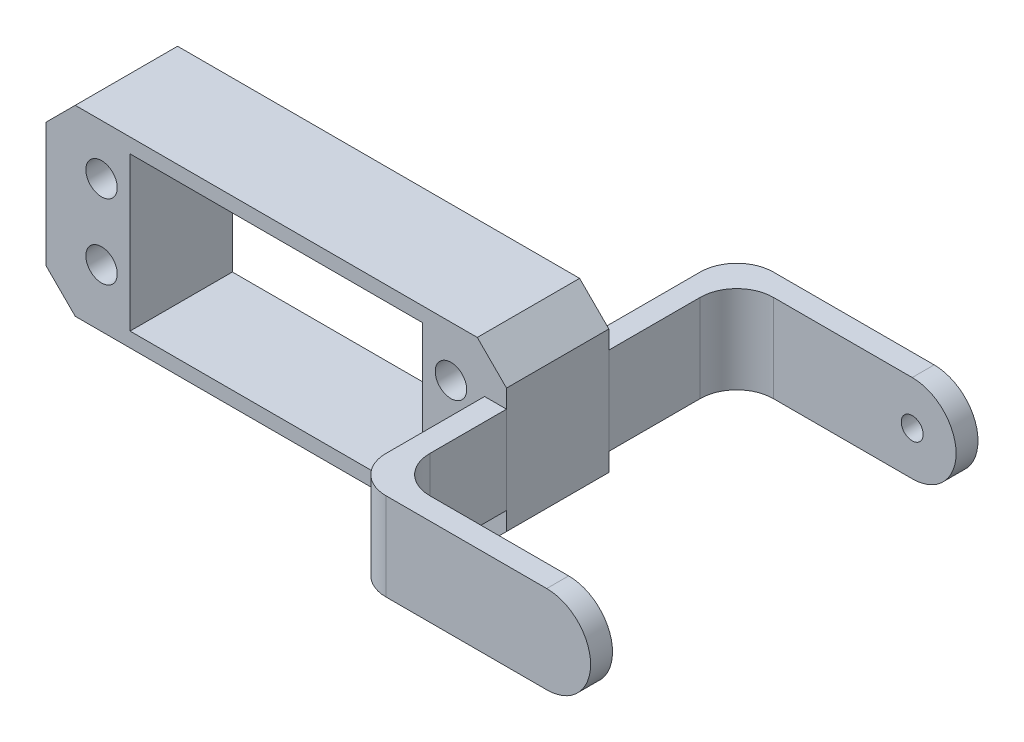
ISO-10303-21;
HEADER;
FILE_DESCRIPTION(('STEP AP214'),'2;1');
FILE_NAME('part.step','',(''),(''),'','','');
FILE_SCHEMA(('AUTOMOTIVE_DESIGN { 1 0 10303 214 1 1 1 1 }'));
ENDSEC;
DATA;
#1=APPLICATION_CONTEXT('core data for automotive mechanical design processes');
#2=APPLICATION_PROTOCOL_DEFINITION('international standard','automotive_design',2000,#1);
#3=PRODUCT_CONTEXT('',#1,'mechanical');
#4=PRODUCT('Part','Part','',(#3));
#5=PRODUCT_RELATED_PRODUCT_CATEGORY('part','',(#4));
#6=PRODUCT_DEFINITION_FORMATION('','',#4);
#7=PRODUCT_DEFINITION_CONTEXT('part definition',#1,'design');
#8=PRODUCT_DEFINITION('design','',#6,#7);
#9=PRODUCT_DEFINITION_SHAPE('','',#8);
#10=(LENGTH_UNIT() NAMED_UNIT(*) SI_UNIT(.MILLI.,.METRE.));
#11=(NAMED_UNIT(*) PLANE_ANGLE_UNIT() SI_UNIT($,.RADIAN.));
#12=(NAMED_UNIT(*) SI_UNIT($,.STERADIAN.) SOLID_ANGLE_UNIT());
#13=UNCERTAINTY_MEASURE_WITH_UNIT(LENGTH_MEASURE(1.E-05),#10,'distance_accuracy_value','');
#14=(GEOMETRIC_REPRESENTATION_CONTEXT(3) GLOBAL_UNCERTAINTY_ASSIGNED_CONTEXT((#13)) GLOBAL_UNIT_ASSIGNED_CONTEXT((#10,
#11,#12)) REPRESENTATION_CONTEXT('',''));
#15=CARTESIAN_POINT('',(0.,0.,0.));
#16=DIRECTION('',(0.,0.,1.));
#17=DIRECTION('',(1.,0.,0.));
#18=AXIS2_PLACEMENT_3D('',#15,#16,#17);
#19=CARTESIAN_POINT('',(33.5,0.,-15.5));
#20=DIRECTION('',(0.,1.,0.));
#21=DIRECTION('',(0.,0.,1.));
#22=AXIS2_PLACEMENT_3D('',#19,#20,#21);
#23=CYLINDRICAL_SURFACE('',#22,5.);
#24=DIRECTION('',(0.,-1.,0.));
#25=VECTOR('',#24,1.);
#26=CARTESIAN_POINT('',(28.5,0.,-15.5));
#27=LINE('',#26,#25);
#28=CARTESIAN_POINT('',(28.5,6.00000000000001,-15.5));
#29=VERTEX_POINT('',#28);
#30=CARTESIAN_POINT('',(28.5,-6.00000000000001,-15.5));
#31=VERTEX_POINT('',#30);
#32=EDGE_CURVE('E170',#29,#31,#27,.T.);
#33=ORIENTED_EDGE('',*,*,#32,.F.);
#34=CARTESIAN_POINT('',(33.5,6.00000000000001,-15.5));
#35=DIRECTION('',(0.,-1.,0.));
#36=DIRECTION('',(0.,0.,-1.));
#37=AXIS2_PLACEMENT_3D('',#34,#35,#36);
#38=CIRCLE('',#37,5.);
#39=CARTESIAN_POINT('',(33.5,6.,-20.5));
#40=VERTEX_POINT('',#39);
#41=EDGE_CURVE('E57',#40,#29,#38,.F.);
#42=ORIENTED_EDGE('',*,*,#41,.F.);
#43=DIRECTION('',(0.,-1.,0.));
#44=VECTOR('',#43,1.);
#45=CARTESIAN_POINT('',(33.5,0.,-20.5));
#46=LINE('',#45,#44);
#47=CARTESIAN_POINT('',(33.5,-6.,-20.5));
#48=VERTEX_POINT('',#47);
#49=EDGE_CURVE('E172',#48,#40,#46,.F.);
#50=ORIENTED_EDGE('',*,*,#49,.F.);
#51=CARTESIAN_POINT('',(33.5,-6.00000000000001,-15.5));
#52=DIRECTION('',(0.,-1.,0.));
#53=DIRECTION('',(0.,0.,-1.));
#54=AXIS2_PLACEMENT_3D('',#51,#52,#53);
#55=CIRCLE('',#54,5.);
#56=EDGE_CURVE('E12',#31,#48,#55,.T.);
#57=ORIENTED_EDGE('',*,*,#56,.F.);
#58=EDGE_LOOP('',(#33,#42,#50,#57));
#59=FACE_BOUND('',#58,.T.);
#60=ADVANCED_FACE('F50',(#59),#23,.T.);
#61=CARTESIAN_POINT('',(36.5,0.,-12.5));
#62=DIRECTION('',(0.,1.,0.));
#63=DIRECTION('',(0.,0.,1.));
#64=AXIS2_PLACEMENT_3D('',#61,#62,#63);
#65=CYLINDRICAL_SURFACE('',#64,5.);
#66=DIRECTION('',(0.,1.,0.));
#67=VECTOR('',#66,1.);
#68=CARTESIAN_POINT('',(31.5,0.,-12.5));
#69=LINE('',#68,#67);
#70=CARTESIAN_POINT('',(31.5,-6.00000000000001,-12.5));
#71=VERTEX_POINT('',#70);
#72=CARTESIAN_POINT('',(31.5,6.00000000000001,-12.5));
#73=VERTEX_POINT('',#72);
#74=EDGE_CURVE('E160',#71,#73,#69,.T.);
#75=ORIENTED_EDGE('',*,*,#74,.F.);
#76=CARTESIAN_POINT('',(36.5,-6.00000000000001,-12.5));
#77=DIRECTION('',(0.,-1.,0.));
#78=DIRECTION('',(0.,0.,-1.));
#79=AXIS2_PLACEMENT_3D('',#76,#77,#78);
#80=CIRCLE('',#79,5.);
#81=CARTESIAN_POINT('',(36.5,-6.00000000000001,-17.5));
#82=VERTEX_POINT('',#81);
#83=EDGE_CURVE('E166',#71,#82,#80,.T.);
#84=ORIENTED_EDGE('',*,*,#83,.T.);
#85=DIRECTION('',(0.,1.,0.));
#86=VECTOR('',#85,1.);
#87=CARTESIAN_POINT('',(36.5,0.,-17.5));
#88=LINE('',#87,#86);
#89=CARTESIAN_POINT('',(36.5,6.,-17.5));
#90=VERTEX_POINT('',#89);
#91=EDGE_CURVE('E163',#90,#82,#88,.F.);
#92=ORIENTED_EDGE('',*,*,#91,.F.);
#93=CARTESIAN_POINT('',(36.5,6.00000000000001,-12.5));
#94=DIRECTION('',(0.,-1.,0.));
#95=DIRECTION('',(0.,0.,-1.));
#96=AXIS2_PLACEMENT_3D('',#93,#94,#95);
#97=CIRCLE('',#96,5.);
#98=EDGE_CURVE('E168',#90,#73,#97,.F.);
#99=ORIENTED_EDGE('',*,*,#98,.T.);
#100=EDGE_LOOP('',(#75,#84,#92,#99));
#101=FACE_BOUND('',#100,.T.);
#102=ADVANCED_FACE('F212',(#101),#65,.F.);
#103=CARTESIAN_POINT('',(55.5,0.,-20.5));
#104=DIRECTION('',(0.,0.,1.));
#105=DIRECTION('',(0.,-1.,0.));
#106=AXIS2_PLACEMENT_3D('',#103,#104,#105);
#107=CYLINDRICAL_SURFACE('',#106,6.);
#108=DIRECTION('',(0.,0.,1.));
#109=VECTOR('',#108,1.);
#110=CARTESIAN_POINT('',(55.5,-6.00000000000002,0.));
#111=LINE('',#110,#109);
#112=CARTESIAN_POINT('',(55.5,-6.,-20.5));
#113=VERTEX_POINT('',#112);
#114=CARTESIAN_POINT('',(55.5,-6.00000000000001,-17.5));
#115=VERTEX_POINT('',#114);
#116=EDGE_CURVE('E146',#113,#115,#111,.T.);
#117=ORIENTED_EDGE('',*,*,#116,.F.);
#118=CARTESIAN_POINT('',(55.5,0.,-20.5));
#119=DIRECTION('',(0.,0.,-1.));
#120=DIRECTION('',(-1.,0.,0.));
#121=AXIS2_PLACEMENT_3D('',#118,#119,#120);
#122=CIRCLE('',#121,6.);
#123=CARTESIAN_POINT('',(55.5,6.,-20.5));
#124=VERTEX_POINT('',#123);
#125=EDGE_CURVE('E155',#124,#113,#122,.T.);
#126=ORIENTED_EDGE('',*,*,#125,.F.);
#127=DIRECTION('',(0.,0.,-1.));
#128=VECTOR('',#127,1.);
#129=CARTESIAN_POINT('',(55.5,6.,-20.5));
#130=LINE('',#129,#128);
#131=CARTESIAN_POINT('',(55.5,6.,-17.5));
#132=VERTEX_POINT('',#131);
#133=EDGE_CURVE('E152',#132,#124,#130,.T.);
#134=ORIENTED_EDGE('',*,*,#133,.F.);
#135=CARTESIAN_POINT('',(55.5,0.,-17.5));
#136=DIRECTION('',(0.,0.,-1.));
#137=DIRECTION('',(0.,1.,0.));
#138=AXIS2_PLACEMENT_3D('',#135,#136,#137);
#139=CIRCLE('',#138,6.);
#140=EDGE_CURVE('E158',#115,#132,#139,.F.);
#141=ORIENTED_EDGE('',*,*,#140,.F.);
#142=EDGE_LOOP('',(#117,#126,#134,#141));
#143=FACE_BOUND('',#142,.T.);
#144=ADVANCED_FACE('F182',(#143),#107,.T.);
#145=CARTESIAN_POINT('',(28.5,-6.00000000000002,0.));
#146=DIRECTION('',(0.,-1.,0.));
#147=DIRECTION('',(0.,0.,-1.));
#148=AXIS2_PLACEMENT_3D('',#145,#146,#147);
#149=PLANE('',#148);
#150=DIRECTION('',(0.,0.,-1.));
#151=VECTOR('',#150,1.);
#152=CARTESIAN_POINT('',(28.5,-6.00000000000002,0.));
#153=LINE('',#152,#151);
#154=CARTESIAN_POINT('',(28.5,-6.,0.));
#155=VERTEX_POINT('',#154);
#156=EDGE_CURVE('E118',#155,#31,#153,.T.);
#157=ORIENTED_EDGE('',*,*,#156,.T.);
#158=ORIENTED_EDGE('',*,*,#56,.T.);
#159=DIRECTION('',(1.,0.,0.));
#160=VECTOR('',#159,1.);
#161=CARTESIAN_POINT('',(28.5,-6.,-20.5));
#162=LINE('',#161,#160);
#163=EDGE_CURVE('E120',#48,#113,#162,.T.);
#164=ORIENTED_EDGE('',*,*,#163,.T.);
#165=ORIENTED_EDGE('',*,*,#116,.T.);
#166=DIRECTION('',(-1.,0.,0.));
#167=VECTOR('',#166,1.);
#168=CARTESIAN_POINT('',(61.5,-6.00000000000001,-17.5));
#169=LINE('',#168,#167);
#170=EDGE_CURVE('E186',#115,#82,#169,.T.);
#171=ORIENTED_EDGE('',*,*,#170,.T.);
#172=ORIENTED_EDGE('',*,*,#83,.F.);
#173=DIRECTION('',(0.,0.,-1.));
#174=VECTOR('',#173,1.);
#175=CARTESIAN_POINT('',(31.5,-6.00000000000002,0.));
#176=LINE('',#175,#174);
#177=CARTESIAN_POINT('',(31.5,-6.,0.));
#178=VERTEX_POINT('',#177);
#179=EDGE_CURVE('E139',#178,#71,#176,.T.);
#180=ORIENTED_EDGE('',*,*,#179,.F.);
#181=DIRECTION('',(1.,0.,0.));
#182=VECTOR('',#181,1.);
#183=CARTESIAN_POINT('',(28.5,-6.,0.));
#184=LINE('',#183,#182);
#185=EDGE_CURVE('E130',#155,#178,#184,.T.);
#186=ORIENTED_EDGE('',*,*,#185,.F.);
#187=EDGE_LOOP('',(#157,#158,#164,#165,#171,#172,#180,#186));
#188=FACE_BOUND('',#187,.T.);
#189=ADVANCED_FACE('F185',(#188),#149,.T.);
#190=CARTESIAN_POINT('',(28.5,0.,0.));
#191=DIRECTION('',(0.,0.,-1.));
#192=DIRECTION('',(-1.,0.,0.));
#193=AXIS2_PLACEMENT_3D('',#190,#191,#192);
#194=PLANE('',#193);
#195=DIRECTION('',(0.,1.,0.));
#196=VECTOR('',#195,1.);
#197=CARTESIAN_POINT('',(31.5,0.,0.));
#198=LINE('',#197,#196);
#199=CARTESIAN_POINT('',(31.5,6.,0.));
#200=VERTEX_POINT('',#199);
#201=EDGE_CURVE('E126',#178,#200,#198,.T.);
#202=ORIENTED_EDGE('',*,*,#201,.T.);
#203=DIRECTION('',(1.,0.,0.));
#204=VECTOR('',#203,1.);
#205=CARTESIAN_POINT('',(28.5,6.,0.));
#206=LINE('',#205,#204);
#207=CARTESIAN_POINT('',(28.5,6.,0.));
#208=VERTEX_POINT('',#207);
#209=EDGE_CURVE('E123',#208,#200,#206,.T.);
#210=ORIENTED_EDGE('',*,*,#209,.F.);
#211=DIRECTION('',(0.,1.,0.));
#212=VECTOR('',#211,1.);
#213=CARTESIAN_POINT('',(28.5,0.,0.));
#214=LINE('',#213,#212);
#215=EDGE_CURVE('E112',#155,#208,#214,.T.);
#216=ORIENTED_EDGE('',*,*,#215,.F.);
#217=ORIENTED_EDGE('',*,*,#185,.T.);
#218=EDGE_LOOP('',(#202,#210,#216,#217));
#219=FACE_BOUND('',#218,.T.);
#220=ADVANCED_FACE('F124',(#219),#194,.F.);
#221=CARTESIAN_POINT('',(28.5,6.00000000000002,0.));
#222=DIRECTION('',(0.,-1.,0.));
#223=DIRECTION('',(0.,0.,-1.));
#224=AXIS2_PLACEMENT_3D('',#221,#222,#223);
#225=PLANE('',#224);
#226=DIRECTION('',(1.,0.,0.));
#227=VECTOR('',#226,1.);
#228=CARTESIAN_POINT('',(28.5,6.,-20.5));
#229=LINE('',#228,#227);
#230=EDGE_CURVE('E131',#40,#124,#229,.T.);
#231=ORIENTED_EDGE('',*,*,#230,.F.);
#232=ORIENTED_EDGE('',*,*,#41,.T.);
#233=DIRECTION('',(0.,0.,-1.));
#234=VECTOR('',#233,1.);
#235=CARTESIAN_POINT('',(28.5,6.00000000000002,0.));
#236=LINE('',#235,#234);
#237=EDGE_CURVE('E117',#208,#29,#236,.T.);
#238=ORIENTED_EDGE('',*,*,#237,.F.);
#239=ORIENTED_EDGE('',*,*,#209,.T.);
#240=DIRECTION('',(0.,0.,-1.));
#241=VECTOR('',#240,1.);
#242=CARTESIAN_POINT('',(31.5,6.00000000000002,0.));
#243=LINE('',#242,#241);
#244=EDGE_CURVE('E142',#200,#73,#243,.T.);
#245=ORIENTED_EDGE('',*,*,#244,.T.);
#246=ORIENTED_EDGE('',*,*,#98,.F.);
#247=DIRECTION('',(-1.,0.,0.));
#248=VECTOR('',#247,1.);
#249=CARTESIAN_POINT('',(61.5,6.,-17.5));
#250=LINE('',#249,#248);
#251=EDGE_CURVE('E143',#132,#90,#250,.T.);
#252=ORIENTED_EDGE('',*,*,#251,.F.);
#253=ORIENTED_EDGE('',*,*,#133,.T.);
#254=EDGE_LOOP('',(#231,#232,#238,#239,#245,#246,#252,#253));
#255=FACE_BOUND('',#254,.T.);
#256=ADVANCED_FACE('F134',(#255),#225,.F.);
#257=CARTESIAN_POINT('',(28.5,0.,-20.5));
#258=DIRECTION('',(0.,0.,-1.));
#259=DIRECTION('',(-1.,0.,0.));
#260=AXIS2_PLACEMENT_3D('',#257,#258,#259);
#261=PLANE('',#260);
#262=CARTESIAN_POINT('',(55.5,0.,-20.5));
#263=DIRECTION('',(0.,0.,-1.));
#264=DIRECTION('',(-1.,0.,0.));
#265=AXIS2_PLACEMENT_3D('',#262,#263,#264);
#266=CIRCLE('',#265,1.5);
#267=CARTESIAN_POINT('',(54.,0.,-20.5));
#268=VERTEX_POINT('',#267);
#269=EDGE_CURVE('E193',#268,#268,#266,.T.);
#270=ORIENTED_EDGE('',*,*,#269,.F.);
#271=EDGE_LOOP('',(#270));
#272=FACE_BOUND('',#271,.T.);
#273=ORIENTED_EDGE('',*,*,#163,.F.);
#274=ORIENTED_EDGE('',*,*,#49,.T.);
#275=ORIENTED_EDGE('',*,*,#230,.T.);
#276=ORIENTED_EDGE('',*,*,#125,.T.);
#277=EDGE_LOOP('',(#273,#274,#275,#276));
#278=FACE_BOUND('',#277,.T.);
#279=ADVANCED_FACE('F175',(#272,#278),#261,.T.);
#280=CARTESIAN_POINT('',(28.5,0.,0.));
#281=DIRECTION('',(1.,0.,0.));
#282=DIRECTION('',(0.,0.,-1.));
#283=AXIS2_PLACEMENT_3D('',#280,#281,#282);
#284=PLANE('',#283);
#285=ORIENTED_EDGE('',*,*,#237,.T.);
#286=ORIENTED_EDGE('',*,*,#32,.T.);
#287=ORIENTED_EDGE('',*,*,#156,.F.);
#288=ORIENTED_EDGE('',*,*,#215,.T.);
#289=EDGE_LOOP('',(#285,#286,#287,#288));
#290=FACE_BOUND('',#289,.T.);
#291=ADVANCED_FACE('F114',(#290),#284,.F.);
#292=CARTESIAN_POINT('',(31.5,0.,0.));
#293=DIRECTION('',(1.,0.,0.));
#294=DIRECTION('',(0.,0.,-1.));
#295=AXIS2_PLACEMENT_3D('',#292,#293,#294);
#296=PLANE('',#295);
#297=ORIENTED_EDGE('',*,*,#179,.T.);
#298=ORIENTED_EDGE('',*,*,#74,.T.);
#299=ORIENTED_EDGE('',*,*,#244,.F.);
#300=ORIENTED_EDGE('',*,*,#201,.F.);
#301=EDGE_LOOP('',(#297,#298,#299,#300));
#302=FACE_BOUND('',#301,.T.);
#303=ADVANCED_FACE('F207',(#302),#296,.T.);
#304=CARTESIAN_POINT('',(61.5,0.,-17.5));
#305=DIRECTION('',(0.,0.,-1.));
#306=DIRECTION('',(0.,1.,0.));
#307=AXIS2_PLACEMENT_3D('',#304,#305,#306);
#308=PLANE('',#307);
#309=CARTESIAN_POINT('',(55.5,0.,-17.5));
#310=DIRECTION('',(0.,0.,-1.));
#311=DIRECTION('',(0.,1.,0.));
#312=AXIS2_PLACEMENT_3D('',#309,#310,#311);
#313=CIRCLE('',#312,1.5);
#314=CARTESIAN_POINT('',(55.5,1.5,-17.5));
#315=VERTEX_POINT('',#314);
#316=EDGE_CURVE('E190',#315,#315,#313,.F.);
#317=ORIENTED_EDGE('',*,*,#316,.F.);
#318=EDGE_LOOP('',(#317));
#319=FACE_BOUND('',#318,.T.);
#320=ORIENTED_EDGE('',*,*,#251,.T.);
#321=ORIENTED_EDGE('',*,*,#91,.T.);
#322=ORIENTED_EDGE('',*,*,#170,.F.);
#323=ORIENTED_EDGE('',*,*,#140,.T.);
#324=EDGE_LOOP('',(#320,#321,#322,#323));
#325=FACE_BOUND('',#324,.T.);
#326=ADVANCED_FACE('F188',(#319,#325),#308,.F.);
#327=CARTESIAN_POINT('',(55.5,0.,-13.2573593128807));
#328=DIRECTION('',(0.,0.,-1.));
#329=DIRECTION('',(-1.,0.,0.));
#330=AXIS2_PLACEMENT_3D('',#327,#328,#329);
#331=CYLINDRICAL_SURFACE('',#330,1.5);
#332=ORIENTED_EDGE('',*,*,#316,.T.);
#333=EDGE_LOOP('',(#332));
#334=FACE_BOUND('',#333,.T.);
#335=ORIENTED_EDGE('',*,*,#269,.T.);
#336=EDGE_LOOP('',(#335));
#337=FACE_BOUND('',#336,.T.);
#338=ADVANCED_FACE('F199',(#334,#337),#331,.F.);
#339=CLOSED_SHELL('',(#60,#102,#144,#189,#220,#256,#279,#291,#303,#326,#338));
#340=MANIFOLD_SOLID_BREP('B2',#339);
#341=CARTESIAN_POINT('',(55.5,0.,29.5));
#342=DIRECTION('',(0.,0.,-1.));
#343=DIRECTION('',(0.,1.,0.));
#344=AXIS2_PLACEMENT_3D('',#341,#342,#343);
#345=CYLINDRICAL_SURFACE('',#344,6.00000000000001);
#346=DIRECTION('',(0.,0.,1.));
#347=VECTOR('',#346,1.);
#348=CARTESIAN_POINT('',(55.5,-6.,29.5));
#349=LINE('',#348,#347);
#350=CARTESIAN_POINT('',(55.5,-6.00000000000001,29.5));
#351=VERTEX_POINT('',#350);
#352=CARTESIAN_POINT('',(55.5,-6.,32.5));
#353=VERTEX_POINT('',#352);
#354=EDGE_CURVE('E454',#351,#353,#349,.T.);
#355=ORIENTED_EDGE('',*,*,#354,.F.);
#356=CARTESIAN_POINT('',(55.5,0.,29.5));
#357=DIRECTION('',(0.,0.,-1.));
#358=DIRECTION('',(0.,1.,0.));
#359=AXIS2_PLACEMENT_3D('',#356,#357,#358);
#360=CIRCLE('',#359,6.00000000000001);
#361=CARTESIAN_POINT('',(55.5,6.00000000000001,29.5));
#362=VERTEX_POINT('',#361);
#363=EDGE_CURVE('E336',#362,#351,#360,.T.);
#364=ORIENTED_EDGE('',*,*,#363,.F.);
#365=DIRECTION('',(0.,0.,-1.));
#366=VECTOR('',#365,1.);
#367=CARTESIAN_POINT('',(55.5,6.,0.));
#368=LINE('',#367,#366);
#369=CARTESIAN_POINT('',(55.5,6.,32.5));
#370=VERTEX_POINT('',#369);
#371=EDGE_CURVE('E457',#370,#362,#368,.T.);
#372=ORIENTED_EDGE('',*,*,#371,.F.);
#373=CARTESIAN_POINT('',(55.5,0.,32.5));
#374=DIRECTION('',(0.,0.,-1.));
#375=DIRECTION('',(-1.,0.,0.));
#376=AXIS2_PLACEMENT_3D('',#373,#374,#375);
#377=CIRCLE('',#376,6.00000000000001);
#378=EDGE_CURVE('E48',#353,#370,#377,.F.);
#379=ORIENTED_EDGE('',*,*,#378,.F.);
#380=EDGE_LOOP('',(#355,#364,#372,#379));
#381=FACE_BOUND('',#380,.T.);
#382=ADVANCED_FACE('F328',(#381),#345,.T.);
#383=CARTESIAN_POINT('',(33.5,0.,27.5));
#384=DIRECTION('',(0.,-1.,0.));
#385=DIRECTION('',(0.,0.,-1.));
#386=AXIS2_PLACEMENT_3D('',#383,#384,#385);
#387=CYLINDRICAL_SURFACE('',#386,5.);
#388=DIRECTION('',(0.,-1.,0.));
#389=VECTOR('',#388,1.);
#390=CARTESIAN_POINT('',(33.5,0.,32.5));
#391=LINE('',#390,#389);
#392=CARTESIAN_POINT('',(33.5,6.,32.5));
#393=VERTEX_POINT('',#392);
#394=CARTESIAN_POINT('',(33.5,-6.,32.5));
#395=VERTEX_POINT('',#394);
#396=EDGE_CURVE('E446',#393,#395,#391,.T.);
#397=ORIENTED_EDGE('',*,*,#396,.F.);
#398=CARTESIAN_POINT('',(33.5,6.,27.5));
#399=DIRECTION('',(0.,1.,0.));
#400=DIRECTION('',(0.,0.,1.));
#401=AXIS2_PLACEMENT_3D('',#398,#399,#400);
#402=CIRCLE('',#401,5.);
#403=CARTESIAN_POINT('',(28.5,6.,27.5));
#404=VERTEX_POINT('',#403);
#405=EDGE_CURVE('E451',#404,#393,#402,.T.);
#406=ORIENTED_EDGE('',*,*,#405,.F.);
#407=DIRECTION('',(0.,-1.,0.));
#408=VECTOR('',#407,1.);
#409=CARTESIAN_POINT('',(28.5,0.,27.5));
#410=LINE('',#409,#408);
#411=CARTESIAN_POINT('',(28.5,-6.00000000000001,27.5));
#412=VERTEX_POINT('',#411);
#413=EDGE_CURVE('E449',#412,#404,#410,.F.);
#414=ORIENTED_EDGE('',*,*,#413,.F.);
#415=CARTESIAN_POINT('',(33.5,-6.00000000000001,27.5));
#416=DIRECTION('',(0.,1.,0.));
#417=DIRECTION('',(0.,0.,1.));
#418=AXIS2_PLACEMENT_3D('',#415,#416,#417);
#419=CIRCLE('',#418,5.);
#420=EDGE_CURVE('E416',#395,#412,#419,.F.);
#421=ORIENTED_EDGE('',*,*,#420,.F.);
#422=EDGE_LOOP('',(#397,#406,#414,#421));
#423=FACE_BOUND('',#422,.T.);
#424=ADVANCED_FACE('F474',(#423),#387,.T.);
#425=CARTESIAN_POINT('',(36.5,0.,24.5));
#426=DIRECTION('',(0.,-1.,0.));
#427=DIRECTION('',(0.,0.,-1.));
#428=AXIS2_PLACEMENT_3D('',#425,#426,#427);
#429=CYLINDRICAL_SURFACE('',#428,5.);
#430=DIRECTION('',(0.,1.,0.));
#431=VECTOR('',#430,1.);
#432=CARTESIAN_POINT('',(36.5,0.,29.5));
#433=LINE('',#432,#431);
#434=CARTESIAN_POINT('',(36.5,-6.00000000000001,29.5));
#435=VERTEX_POINT('',#434);
#436=CARTESIAN_POINT('',(36.5,6.00000000000001,29.5));
#437=VERTEX_POINT('',#436);
#438=EDGE_CURVE('E433',#435,#437,#433,.T.);
#439=ORIENTED_EDGE('',*,*,#438,.F.);
#440=CARTESIAN_POINT('',(36.5,-6.00000000000001,24.5));
#441=DIRECTION('',(0.,1.,0.));
#442=DIRECTION('',(0.,0.,1.));
#443=AXIS2_PLACEMENT_3D('',#440,#441,#442);
#444=CIRCLE('',#443,5.);
#445=CARTESIAN_POINT('',(31.5,-6.00000000000001,24.5));
#446=VERTEX_POINT('',#445);
#447=EDGE_CURVE('E441',#435,#446,#444,.F.);
#448=ORIENTED_EDGE('',*,*,#447,.T.);
#449=DIRECTION('',(0.,1.,0.));
#450=VECTOR('',#449,1.);
#451=CARTESIAN_POINT('',(31.5,0.,24.5));
#452=LINE('',#451,#450);
#453=CARTESIAN_POINT('',(31.5,6.,24.5));
#454=VERTEX_POINT('',#453);
#455=EDGE_CURVE('E438',#454,#446,#452,.F.);
#456=ORIENTED_EDGE('',*,*,#455,.F.);
#457=CARTESIAN_POINT('',(36.5,6.,24.5));
#458=DIRECTION('',(0.,1.,0.));
#459=DIRECTION('',(0.,0.,1.));
#460=AXIS2_PLACEMENT_3D('',#457,#458,#459);
#461=CIRCLE('',#460,5.);
#462=EDGE_CURVE('E443',#454,#437,#461,.T.);
#463=ORIENTED_EDGE('',*,*,#462,.T.);
#464=EDGE_LOOP('',(#439,#448,#456,#463));
#465=FACE_BOUND('',#464,.T.);
#466=ADVANCED_FACE('F469',(#465),#429,.F.);
#467=CARTESIAN_POINT('',(31.5,0.,0.));
#468=DIRECTION('',(1.,0.,0.));
#469=DIRECTION('',(0.,0.,-1.));
#470=AXIS2_PLACEMENT_3D('',#467,#468,#469);
#471=PLANE('',#470);
#472=DIRECTION('',(0.,0.,1.));
#473=VECTOR('',#472,1.);
#474=CARTESIAN_POINT('',(31.5,6.,0.));
#475=LINE('',#474,#473);
#476=CARTESIAN_POINT('',(31.5,6.,14.));
#477=VERTEX_POINT('',#476);
#478=EDGE_CURVE('E418',#477,#454,#475,.T.);
#479=ORIENTED_EDGE('',*,*,#478,.T.);
#480=ORIENTED_EDGE('',*,*,#455,.T.);
#481=DIRECTION('',(0.,0.,1.));
#482=VECTOR('',#481,1.);
#483=CARTESIAN_POINT('',(31.5,-6.00000000000005,0.));
#484=LINE('',#483,#482);
#485=CARTESIAN_POINT('',(31.5,-6.,14.));
#486=VERTEX_POINT('',#485);
#487=EDGE_CURVE('E427',#486,#446,#484,.T.);
#488=ORIENTED_EDGE('',*,*,#487,.F.);
#489=DIRECTION('',(0.,-1.,0.));
#490=VECTOR('',#489,1.);
#491=CARTESIAN_POINT('',(31.5,0.,14.));
#492=LINE('',#491,#490);
#493=EDGE_CURVE('E406',#477,#486,#492,.T.);
#494=ORIENTED_EDGE('',*,*,#493,.F.);
#495=EDGE_LOOP('',(#479,#480,#488,#494));
#496=FACE_BOUND('',#495,.T.);
#497=ADVANCED_FACE('F471',(#496),#471,.T.);
#498=CARTESIAN_POINT('',(28.5,0.,32.5));
#499=DIRECTION('',(0.,0.,-1.));
#500=DIRECTION('',(-1.,0.,0.));
#501=AXIS2_PLACEMENT_3D('',#498,#499,#500);
#502=PLANE('',#501);
#503=DIRECTION('',(1.,0.,0.));
#504=VECTOR('',#503,1.);
#505=CARTESIAN_POINT('',(28.5,-6.,32.5));
#506=LINE('',#505,#504);
#507=EDGE_CURVE('E411',#395,#353,#506,.T.);
#508=ORIENTED_EDGE('',*,*,#507,.T.);
#509=ORIENTED_EDGE('',*,*,#378,.T.);
#510=DIRECTION('',(1.,0.,0.));
#511=VECTOR('',#510,1.);
#512=CARTESIAN_POINT('',(28.5,6.,32.5));
#513=LINE('',#512,#511);
#514=EDGE_CURVE('E430',#393,#370,#513,.T.);
#515=ORIENTED_EDGE('',*,*,#514,.F.);
#516=ORIENTED_EDGE('',*,*,#396,.T.);
#517=EDGE_LOOP('',(#508,#509,#515,#516));
#518=FACE_BOUND('',#517,.T.);
#519=ADVANCED_FACE('F475',(#518),#502,.F.);
#520=CARTESIAN_POINT('',(28.5,6.,0.));
#521=DIRECTION('',(0.,1.,0.));
#522=DIRECTION('',(0.,0.,1.));
#523=AXIS2_PLACEMENT_3D('',#520,#521,#522);
#524=PLANE('',#523);
#525=ORIENTED_EDGE('',*,*,#514,.T.);
#526=ORIENTED_EDGE('',*,*,#371,.T.);
#527=DIRECTION('',(-1.,0.,0.));
#528=VECTOR('',#527,1.);
#529=CARTESIAN_POINT('',(61.5,6.00000000000001,29.5));
#530=LINE('',#529,#528);
#531=EDGE_CURVE('E423',#362,#437,#530,.T.);
#532=ORIENTED_EDGE('',*,*,#531,.T.);
#533=ORIENTED_EDGE('',*,*,#462,.F.);
#534=ORIENTED_EDGE('',*,*,#478,.F.);
#535=DIRECTION('',(1.,0.,0.));
#536=VECTOR('',#535,1.);
#537=CARTESIAN_POINT('',(28.5,6.,14.));
#538=LINE('',#537,#536);
#539=CARTESIAN_POINT('',(28.5,6.,14.));
#540=VERTEX_POINT('',#539);
#541=EDGE_CURVE('E410',#540,#477,#538,.T.);
#542=ORIENTED_EDGE('',*,*,#541,.F.);
#543=DIRECTION('',(0.,0.,1.));
#544=VECTOR('',#543,1.);
#545=CARTESIAN_POINT('',(28.5,6.,0.));
#546=LINE('',#545,#544);
#547=EDGE_CURVE('E399',#540,#404,#546,.T.);
#548=ORIENTED_EDGE('',*,*,#547,.T.);
#549=ORIENTED_EDGE('',*,*,#405,.T.);
#550=EDGE_LOOP('',(#525,#526,#532,#533,#534,#542,#548,#549));
#551=FACE_BOUND('',#550,.T.);
#552=ADVANCED_FACE('F465',(#551),#524,.T.);
#553=CARTESIAN_POINT('',(28.5,0.,14.));
#554=DIRECTION('',(0.,0.,1.));
#555=DIRECTION('',(1.,0.,0.));
#556=AXIS2_PLACEMENT_3D('',#553,#554,#555);
#557=PLANE('',#556);
#558=ORIENTED_EDGE('',*,*,#493,.T.);
#559=DIRECTION('',(1.,0.,0.));
#560=VECTOR('',#559,1.);
#561=CARTESIAN_POINT('',(28.5,-6.,14.));
#562=LINE('',#561,#560);
#563=CARTESIAN_POINT('',(28.5,-6.,14.));
#564=VERTEX_POINT('',#563);
#565=EDGE_CURVE('E403',#564,#486,#562,.T.);
#566=ORIENTED_EDGE('',*,*,#565,.F.);
#567=DIRECTION('',(0.,-1.,0.));
#568=VECTOR('',#567,1.);
#569=CARTESIAN_POINT('',(28.5,0.,14.));
#570=LINE('',#569,#568);
#571=EDGE_CURVE('E392',#540,#564,#570,.T.);
#572=ORIENTED_EDGE('',*,*,#571,.F.);
#573=ORIENTED_EDGE('',*,*,#541,.T.);
#574=EDGE_LOOP('',(#558,#566,#572,#573));
#575=FACE_BOUND('',#574,.T.);
#576=ADVANCED_FACE('F404',(#575),#557,.F.);
#577=CARTESIAN_POINT('',(28.5,-6.00000000000005,0.));
#578=DIRECTION('',(0.,1.,0.));
#579=DIRECTION('',(0.,0.,1.));
#580=AXIS2_PLACEMENT_3D('',#577,#578,#579);
#581=PLANE('',#580);
#582=DIRECTION('',(-1.,0.,0.));
#583=VECTOR('',#582,1.);
#584=CARTESIAN_POINT('',(61.5,-6.00000000000001,29.5));
#585=LINE('',#584,#583);
#586=EDGE_CURVE('E461',#351,#435,#585,.T.);
#587=ORIENTED_EDGE('',*,*,#586,.F.);
#588=ORIENTED_EDGE('',*,*,#354,.T.);
#589=ORIENTED_EDGE('',*,*,#507,.F.);
#590=ORIENTED_EDGE('',*,*,#420,.T.);
#591=DIRECTION('',(0.,0.,1.));
#592=VECTOR('',#591,1.);
#593=CARTESIAN_POINT('',(28.5,-6.00000000000005,0.));
#594=LINE('',#593,#592);
#595=EDGE_CURVE('E397',#564,#412,#594,.T.);
#596=ORIENTED_EDGE('',*,*,#595,.F.);
#597=ORIENTED_EDGE('',*,*,#565,.T.);
#598=ORIENTED_EDGE('',*,*,#487,.T.);
#599=ORIENTED_EDGE('',*,*,#447,.F.);
#600=EDGE_LOOP('',(#587,#588,#589,#590,#596,#597,#598,#599));
#601=FACE_BOUND('',#600,.T.);
#602=ADVANCED_FACE('F414',(#601),#581,.F.);
#603=CARTESIAN_POINT('',(28.5,0.,0.));
#604=DIRECTION('',(1.,0.,0.));
#605=DIRECTION('',(0.,0.,-1.));
#606=AXIS2_PLACEMENT_3D('',#603,#604,#605);
#607=PLANE('',#606);
#608=ORIENTED_EDGE('',*,*,#595,.T.);
#609=ORIENTED_EDGE('',*,*,#413,.T.);
#610=ORIENTED_EDGE('',*,*,#547,.F.);
#611=ORIENTED_EDGE('',*,*,#571,.T.);
#612=EDGE_LOOP('',(#608,#609,#610,#611));
#613=FACE_BOUND('',#612,.T.);
#614=ADVANCED_FACE('F394',(#613),#607,.F.);
#615=CARTESIAN_POINT('',(61.5,0.,29.5));
#616=DIRECTION('',(0.,0.,-1.));
#617=DIRECTION('',(0.,1.,0.));
#618=AXIS2_PLACEMENT_3D('',#615,#616,#617);
#619=PLANE('',#618);
#620=ORIENTED_EDGE('',*,*,#531,.F.);
#621=ORIENTED_EDGE('',*,*,#363,.T.);
#622=ORIENTED_EDGE('',*,*,#586,.T.);
#623=ORIENTED_EDGE('',*,*,#438,.T.);
#624=EDGE_LOOP('',(#620,#621,#622,#623));
#625=FACE_BOUND('',#624,.T.);
#626=ADVANCED_FACE('F460',(#625),#619,.T.);
#627=CLOSED_SHELL('',(#382,#424,#466,#497,#519,#552,#576,#602,#614,#626));
#628=MANIFOLD_SOLID_BREP('B6',#627);
#629=CARTESIAN_POINT('',(0.,0.,14.));
#630=DIRECTION('',(0.,0.,1.));
#631=DIRECTION('',(1.,0.,0.));
#632=AXIS2_PLACEMENT_3D('',#629,#630,#631);
#633=PLANE('',#632);
#634=CARTESIAN_POINT('',(23.9,-4.60000000000001,14.));
#635=DIRECTION('',(0.,0.,-1.));
#636=DIRECTION('',(-1.,0.,0.));
#637=AXIS2_PLACEMENT_3D('',#634,#635,#636);
#638=CIRCLE('',#637,2.15);
#639=CARTESIAN_POINT('',(21.75,-4.60000000000001,14.));
#640=VERTEX_POINT('',#639);
#641=EDGE_CURVE('E883',#640,#640,#638,.T.);
#642=ORIENTED_EDGE('',*,*,#641,.T.);
#643=EDGE_LOOP('',(#642));
#644=FACE_BOUND('',#643,.T.);
#645=CARTESIAN_POINT('',(-23.8999999999999,5.59999999999998,14.));
#646=DIRECTION('',(0.,0.,-1.));
#647=DIRECTION('',(-1.,0.,0.));
#648=AXIS2_PLACEMENT_3D('',#645,#646,#647);
#649=CIRCLE('',#648,2.15);
#650=CARTESIAN_POINT('',(-26.0499999999999,5.59999999999998,14.));
#651=VERTEX_POINT('',#650);
#652=EDGE_CURVE('E889',#651,#651,#649,.T.);
#653=ORIENTED_EDGE('',*,*,#652,.T.);
#654=EDGE_LOOP('',(#653));
#655=FACE_BOUND('',#654,.T.);
#656=CARTESIAN_POINT('',(-23.8999999999999,-4.60000000000001,14.));
#657=DIRECTION('',(0.,0.,-1.));
#658=DIRECTION('',(-1.,0.,0.));
#659=AXIS2_PLACEMENT_3D('',#656,#657,#658);
#660=CIRCLE('',#659,2.15);
#661=CARTESIAN_POINT('',(-26.05,-4.60000000000001,14.));
#662=VERTEX_POINT('',#661);
#663=EDGE_CURVE('E874',#662,#662,#660,.T.);
#664=ORIENTED_EDGE('',*,*,#663,.T.);
#665=EDGE_LOOP('',(#664));
#666=FACE_BOUND('',#665,.T.);
#667=CARTESIAN_POINT('',(23.9,5.59999999999999,14.));
#668=DIRECTION('',(0.,0.,-1.));
#669=DIRECTION('',(-1.,0.,0.));
#670=AXIS2_PLACEMENT_3D('',#667,#668,#669);
#671=CIRCLE('',#670,2.15);
#672=CARTESIAN_POINT('',(21.75,5.59999999999999,14.));
#673=VERTEX_POINT('',#672);
#674=EDGE_CURVE('E714',#673,#673,#671,.T.);
#675=ORIENTED_EDGE('',*,*,#674,.T.);
#676=EDGE_LOOP('',(#675));
#677=FACE_BOUND('',#676,.T.);
#678=DIRECTION('',(0.,-1.,0.));
#679=VECTOR('',#678,1.);
#680=CARTESIAN_POINT('',(-31.5,8.50000000000001,14.));
#681=LINE('',#680,#679);
#682=CARTESIAN_POINT('',(-31.5,8.50000000000001,14.));
#683=VERTEX_POINT('',#682);
#684=CARTESIAN_POINT('',(-31.5,-8.50000000000004,14.));
#685=VERTEX_POINT('',#684);
#686=EDGE_CURVE('E724',#683,#685,#681,.T.);
#687=ORIENTED_EDGE('',*,*,#686,.T.);
#688=DIRECTION('',(0.707106781186555,-0.70710678118654,0.));
#689=VECTOR('',#688,1.);
#690=CARTESIAN_POINT('',(-27.5,-12.5,14.));
#691=LINE('',#690,#689);
#692=CARTESIAN_POINT('',(-27.5,-12.5,14.));
#693=VERTEX_POINT('',#692);
#694=EDGE_CURVE('E727',#685,#693,#691,.T.);
#695=ORIENTED_EDGE('',*,*,#694,.T.);
#696=DIRECTION('',(1.,0.,0.));
#697=VECTOR('',#696,1.);
#698=CARTESIAN_POINT('',(-27.5,-12.5,14.));
#699=LINE('',#698,#697);
#700=CARTESIAN_POINT('',(27.5,-12.5,14.));
#701=VERTEX_POINT('',#700);
#702=EDGE_CURVE('E730',#693,#701,#699,.T.);
#703=ORIENTED_EDGE('',*,*,#702,.T.);
#704=DIRECTION('',(0.707106781186549,0.707106781186546,0.));
#705=VECTOR('',#704,1.);
#706=CARTESIAN_POINT('',(27.5,-12.5,14.));
#707=LINE('',#706,#705);
#708=CARTESIAN_POINT('',(31.5,-8.50000000000001,14.));
#709=VERTEX_POINT('',#708);
#710=EDGE_CURVE('E732',#701,#709,#707,.T.);
#711=ORIENTED_EDGE('',*,*,#710,.T.);
#712=DIRECTION('',(0.,1.,0.));
#713=VECTOR('',#712,1.);
#714=CARTESIAN_POINT('',(31.5,8.50000000000001,14.));
#715=LINE('',#714,#713);
#716=CARTESIAN_POINT('',(31.5,8.50000000000001,14.));
#717=VERTEX_POINT('',#716);
#718=EDGE_CURVE('E734',#709,#717,#715,.T.);
#719=ORIENTED_EDGE('',*,*,#718,.T.);
#720=DIRECTION('',(-0.707106781186549,0.707106781186546,0.));
#721=VECTOR('',#720,1.);
#722=CARTESIAN_POINT('',(27.5,12.5,14.));
#723=LINE('',#722,#721);
#724=CARTESIAN_POINT('',(27.5,12.5,14.));
#725=VERTEX_POINT('',#724);
#726=EDGE_CURVE('E736',#717,#725,#723,.T.);
#727=ORIENTED_EDGE('',*,*,#726,.T.);
#728=DIRECTION('',(-1.,0.,0.));
#729=VECTOR('',#728,1.);
#730=CARTESIAN_POINT('',(-27.5,12.5,14.));
#731=LINE('',#730,#729);
#732=CARTESIAN_POINT('',(-27.5,12.5,14.));
#733=VERTEX_POINT('',#732);
#734=EDGE_CURVE('E738',#725,#733,#731,.T.);
#735=ORIENTED_EDGE('',*,*,#734,.T.);
#736=DIRECTION('',(-0.707106781186549,-0.707106781186546,0.));
#737=VECTOR('',#736,1.);
#738=CARTESIAN_POINT('',(-27.5,12.5,14.));
#739=LINE('',#738,#737);
#740=EDGE_CURVE('E740',#733,#683,#739,.T.);
#741=ORIENTED_EDGE('',*,*,#740,.T.);
#742=EDGE_LOOP('',(#687,#695,#703,#711,#719,#727,#735,#741));
#743=FACE_BOUND('',#742,.T.);
#744=DIRECTION('',(-1.,0.,0.));
#745=VECTOR('',#744,1.);
#746=CARTESIAN_POINT('',(-20.,10.5,14.));
#747=LINE('',#746,#745);
#748=CARTESIAN_POINT('',(20.,10.5,14.));
#749=VERTEX_POINT('',#748);
#750=CARTESIAN_POINT('',(-20.,10.5,14.));
#751=VERTEX_POINT('',#750);
#752=EDGE_CURVE('E694',#749,#751,#747,.T.);
#753=ORIENTED_EDGE('',*,*,#752,.F.);
#754=DIRECTION('',(0.,1.,0.));
#755=VECTOR('',#754,1.);
#756=CARTESIAN_POINT('',(20.,10.5,14.));
#757=LINE('',#756,#755);
#758=CARTESIAN_POINT('',(20.,-10.5,14.));
#759=VERTEX_POINT('',#758);
#760=EDGE_CURVE('E686',#759,#749,#757,.T.);
#761=ORIENTED_EDGE('',*,*,#760,.F.);
#762=DIRECTION('',(1.,0.,0.));
#763=VECTOR('',#762,1.);
#764=CARTESIAN_POINT('',(-20.,-10.5,14.));
#765=LINE('',#764,#763);
#766=CARTESIAN_POINT('',(-20.,-10.5,14.));
#767=VERTEX_POINT('',#766);
#768=EDGE_CURVE('E708',#767,#759,#765,.T.);
#769=ORIENTED_EDGE('',*,*,#768,.F.);
#770=DIRECTION('',(0.,-1.,0.));
#771=VECTOR('',#770,1.);
#772=CARTESIAN_POINT('',(-20.,10.5,14.));
#773=LINE('',#772,#771);
#774=EDGE_CURVE('E706',#751,#767,#773,.T.);
#775=ORIENTED_EDGE('',*,*,#774,.F.);
#776=EDGE_LOOP('',(#753,#761,#769,#775));
#777=FACE_BOUND('',#776,.T.);
#778=ADVANCED_FACE('F597',(#644,#655,#666,#677,#743,#777),#633,.T.);
#779=CARTESIAN_POINT('',(0.,0.,0.));
#780=DIRECTION('',(0.,0.,1.));
#781=DIRECTION('',(1.,0.,0.));
#782=AXIS2_PLACEMENT_3D('',#779,#780,#781);
#783=PLANE('',#782);
#784=CARTESIAN_POINT('',(23.9,-4.60000000000001,0.));
#785=DIRECTION('',(0.,0.,-1.));
#786=DIRECTION('',(-1.,0.,0.));
#787=AXIS2_PLACEMENT_3D('',#784,#785,#786);
#788=CIRCLE('',#787,2.15);
#789=CARTESIAN_POINT('',(21.75,-4.60000000000001,0.));
#790=VERTEX_POINT('',#789);
#791=EDGE_CURVE('E886',#790,#790,#788,.T.);
#792=ORIENTED_EDGE('',*,*,#791,.F.);
#793=EDGE_LOOP('',(#792));
#794=FACE_BOUND('',#793,.T.);
#795=CARTESIAN_POINT('',(-23.8999999999999,5.59999999999998,0.));
#796=DIRECTION('',(0.,0.,-1.));
#797=DIRECTION('',(-1.,0.,0.));
#798=AXIS2_PLACEMENT_3D('',#795,#796,#797);
#799=CIRCLE('',#798,2.15);
#800=CARTESIAN_POINT('',(-26.0499999999999,5.59999999999998,0.));
#801=VERTEX_POINT('',#800);
#802=EDGE_CURVE('E880',#801,#801,#799,.T.);
#803=ORIENTED_EDGE('',*,*,#802,.F.);
#804=EDGE_LOOP('',(#803));
#805=FACE_BOUND('',#804,.T.);
#806=CARTESIAN_POINT('',(-23.8999999999999,-4.60000000000001,0.));
#807=DIRECTION('',(0.,0.,-1.));
#808=DIRECTION('',(-1.,0.,0.));
#809=AXIS2_PLACEMENT_3D('',#806,#807,#808);
#810=CIRCLE('',#809,2.15);
#811=CARTESIAN_POINT('',(-26.05,-4.60000000000001,0.));
#812=VERTEX_POINT('',#811);
#813=EDGE_CURVE('E877',#812,#812,#810,.T.);
#814=ORIENTED_EDGE('',*,*,#813,.F.);
#815=EDGE_LOOP('',(#814));
#816=FACE_BOUND('',#815,.T.);
#817=CARTESIAN_POINT('',(23.9,5.59999999999999,0.));
#818=DIRECTION('',(0.,0.,-1.));
#819=DIRECTION('',(-1.,0.,0.));
#820=AXIS2_PLACEMENT_3D('',#817,#818,#819);
#821=CIRCLE('',#820,2.15);
#822=CARTESIAN_POINT('',(21.75,5.59999999999999,0.));
#823=VERTEX_POINT('',#822);
#824=EDGE_CURVE('E885',#823,#823,#821,.T.);
#825=ORIENTED_EDGE('',*,*,#824,.F.);
#826=EDGE_LOOP('',(#825));
#827=FACE_BOUND('',#826,.T.);
#828=DIRECTION('',(0.,-1.,0.));
#829=VECTOR('',#828,1.);
#830=CARTESIAN_POINT('',(-31.5,8.50000000000001,0.));
#831=LINE('',#830,#829);
#832=CARTESIAN_POINT('',(-31.5,8.50000000000001,0.));
#833=VERTEX_POINT('',#832);
#834=CARTESIAN_POINT('',(-31.5,-8.50000000000004,0.));
#835=VERTEX_POINT('',#834);
#836=EDGE_CURVE('E702',#833,#835,#831,.T.);
#837=ORIENTED_EDGE('',*,*,#836,.F.);
#838=DIRECTION('',(-0.707106781186549,-0.707106781186546,0.));
#839=VECTOR('',#838,1.);
#840=CARTESIAN_POINT('',(-27.5,12.5,0.));
#841=LINE('',#840,#839);
#842=CARTESIAN_POINT('',(-27.5,12.5,0.));
#843=VERTEX_POINT('',#842);
#844=EDGE_CURVE('E728',#843,#833,#841,.T.);
#845=ORIENTED_EDGE('',*,*,#844,.F.);
#846=DIRECTION('',(-1.,0.,0.));
#847=VECTOR('',#846,1.);
#848=CARTESIAN_POINT('',(-27.5,12.5,0.));
#849=LINE('',#848,#847);
#850=CARTESIAN_POINT('',(27.5,12.5,0.));
#851=VERTEX_POINT('',#850);
#852=EDGE_CURVE('E755',#851,#843,#849,.T.);
#853=ORIENTED_EDGE('',*,*,#852,.F.);
#854=DIRECTION('',(-0.707106781186549,0.707106781186546,0.));
#855=VECTOR('',#854,1.);
#856=CARTESIAN_POINT('',(27.5,12.5,0.));
#857=LINE('',#856,#855);
#858=CARTESIAN_POINT('',(31.5,8.50000000000001,0.));
#859=VERTEX_POINT('',#858);
#860=EDGE_CURVE('E753',#859,#851,#857,.T.);
#861=ORIENTED_EDGE('',*,*,#860,.F.);
#862=DIRECTION('',(0.,1.,0.));
#863=VECTOR('',#862,1.);
#864=CARTESIAN_POINT('',(31.5,8.50000000000001,0.));
#865=LINE('',#864,#863);
#866=CARTESIAN_POINT('',(31.5,-8.50000000000001,0.));
#867=VERTEX_POINT('',#866);
#868=EDGE_CURVE('E751',#867,#859,#865,.T.);
#869=ORIENTED_EDGE('',*,*,#868,.F.);
#870=DIRECTION('',(0.707106781186549,0.707106781186546,0.));
#871=VECTOR('',#870,1.);
#872=CARTESIAN_POINT('',(27.5,-12.5,0.));
#873=LINE('',#872,#871);
#874=CARTESIAN_POINT('',(27.5,-12.5,0.));
#875=VERTEX_POINT('',#874);
#876=EDGE_CURVE('E749',#875,#867,#873,.T.);
#877=ORIENTED_EDGE('',*,*,#876,.F.);
#878=DIRECTION('',(1.,0.,0.));
#879=VECTOR('',#878,1.);
#880=CARTESIAN_POINT('',(-27.5,-12.5,0.));
#881=LINE('',#880,#879);
#882=CARTESIAN_POINT('',(-27.5,-12.5,0.));
#883=VERTEX_POINT('',#882);
#884=EDGE_CURVE('E747',#883,#875,#881,.T.);
#885=ORIENTED_EDGE('',*,*,#884,.F.);
#886=DIRECTION('',(0.707106781186555,-0.70710678118654,0.));
#887=VECTOR('',#886,1.);
#888=CARTESIAN_POINT('',(-27.5,-12.5,0.));
#889=LINE('',#888,#887);
#890=EDGE_CURVE('E745',#835,#883,#889,.T.);
#891=ORIENTED_EDGE('',*,*,#890,.F.);
#892=EDGE_LOOP('',(#837,#845,#853,#861,#869,#877,#885,#891));
#893=FACE_BOUND('',#892,.T.);
#894=DIRECTION('',(0.,1.,0.));
#895=VECTOR('',#894,1.);
#896=CARTESIAN_POINT('',(20.,10.5,0.));
#897=LINE('',#896,#895);
#898=CARTESIAN_POINT('',(20.,-10.5,0.));
#899=VERTEX_POINT('',#898);
#900=CARTESIAN_POINT('',(20.,10.5,0.));
#901=VERTEX_POINT('',#900);
#902=EDGE_CURVE('E620',#899,#901,#897,.T.);
#903=ORIENTED_EDGE('',*,*,#902,.T.);
#904=DIRECTION('',(-1.,0.,0.));
#905=VECTOR('',#904,1.);
#906=CARTESIAN_POINT('',(-20.,10.5,0.));
#907=LINE('',#906,#905);
#908=CARTESIAN_POINT('',(-20.,10.5,0.));
#909=VERTEX_POINT('',#908);
#910=EDGE_CURVE('E701',#901,#909,#907,.T.);
#911=ORIENTED_EDGE('',*,*,#910,.T.);
#912=DIRECTION('',(0.,-1.,0.));
#913=VECTOR('',#912,1.);
#914=CARTESIAN_POINT('',(-20.,10.5,0.));
#915=LINE('',#914,#913);
#916=CARTESIAN_POINT('',(-20.,-10.5,0.));
#917=VERTEX_POINT('',#916);
#918=EDGE_CURVE('E716',#909,#917,#915,.T.);
#919=ORIENTED_EDGE('',*,*,#918,.T.);
#920=DIRECTION('',(1.,0.,0.));
#921=VECTOR('',#920,1.);
#922=CARTESIAN_POINT('',(-20.,-10.5,0.));
#923=LINE('',#922,#921);
#924=EDGE_CURVE('E695',#917,#899,#923,.T.);
#925=ORIENTED_EDGE('',*,*,#924,.T.);
#926=EDGE_LOOP('',(#903,#911,#919,#925));
#927=FACE_BOUND('',#926,.T.);
#928=ADVANCED_FACE('F785',(#794,#805,#816,#827,#893,#927),#783,.F.);
#929=CARTESIAN_POINT('',(-31.5,8.50000000000001,14.));
#930=DIRECTION('',(1.,0.,0.));
#931=DIRECTION('',(0.,1.,0.));
#932=AXIS2_PLACEMENT_3D('',#929,#930,#931);
#933=PLANE('',#932);
#934=ORIENTED_EDGE('',*,*,#836,.T.);
#935=DIRECTION('',(0.,0.,-1.));
#936=VECTOR('',#935,1.);
#937=CARTESIAN_POINT('',(-31.5,-8.50000000000004,14.));
#938=LINE('',#937,#936);
#939=EDGE_CURVE('E326',#685,#835,#938,.T.);
#940=ORIENTED_EDGE('',*,*,#939,.F.);
#941=ORIENTED_EDGE('',*,*,#686,.F.);
#942=DIRECTION('',(0.,0.,-1.));
#943=VECTOR('',#942,1.);
#944=CARTESIAN_POINT('',(-31.5,8.50000000000001,14.));
#945=LINE('',#944,#943);
#946=EDGE_CURVE('E742',#683,#833,#945,.T.);
#947=ORIENTED_EDGE('',*,*,#946,.T.);
#948=EDGE_LOOP('',(#934,#940,#941,#947));
#949=FACE_BOUND('',#948,.T.);
#950=ADVANCED_FACE('F599',(#949),#933,.F.);
#951=CARTESIAN_POINT('',(-27.5,-12.5,14.));
#952=DIRECTION('',(0.70710678118654,0.707106781186555,0.));
#953=DIRECTION('',(-0.707106781186555,0.70710678118654,0.));
#954=AXIS2_PLACEMENT_3D('',#951,#952,#953);
#955=PLANE('',#954);
#956=ORIENTED_EDGE('',*,*,#890,.T.);
#957=DIRECTION('',(0.,0.,-1.));
#958=VECTOR('',#957,1.);
#959=CARTESIAN_POINT('',(-27.5,-12.5,14.));
#960=LINE('',#959,#958);
#961=EDGE_CURVE('E605',#693,#883,#960,.T.);
#962=ORIENTED_EDGE('',*,*,#961,.F.);
#963=ORIENTED_EDGE('',*,*,#694,.F.);
#964=ORIENTED_EDGE('',*,*,#939,.T.);
#965=EDGE_LOOP('',(#956,#962,#963,#964));
#966=FACE_BOUND('',#965,.T.);
#967=ADVANCED_FACE('F802',(#966),#955,.F.);
#968=CARTESIAN_POINT('',(-27.5,-12.5,14.));
#969=DIRECTION('',(0.,1.,0.));
#970=DIRECTION('',(0.,0.,1.));
#971=AXIS2_PLACEMENT_3D('',#968,#969,#970);
#972=PLANE('',#971);
#973=ORIENTED_EDGE('',*,*,#884,.T.);
#974=DIRECTION('',(0.,0.,-1.));
#975=VECTOR('',#974,1.);
#976=CARTESIAN_POINT('',(27.5,-12.5,14.));
#977=LINE('',#976,#975);
#978=EDGE_CURVE('E772',#701,#875,#977,.T.);
#979=ORIENTED_EDGE('',*,*,#978,.F.);
#980=ORIENTED_EDGE('',*,*,#702,.F.);
#981=ORIENTED_EDGE('',*,*,#961,.T.);
#982=EDGE_LOOP('',(#973,#979,#980,#981));
#983=FACE_BOUND('',#982,.T.);
#984=ADVANCED_FACE('F779',(#983),#972,.F.);
#985=CARTESIAN_POINT('',(27.5,-12.5,14.));
#986=DIRECTION('',(-0.707106781186546,0.707106781186549,0.));
#987=DIRECTION('',(-0.707106781186549,-0.707106781186546,0.));
#988=AXIS2_PLACEMENT_3D('',#985,#986,#987);
#989=PLANE('',#988);
#990=ORIENTED_EDGE('',*,*,#876,.T.);
#991=DIRECTION('',(0.,0.,-1.));
#992=VECTOR('',#991,1.);
#993=CARTESIAN_POINT('',(31.5,-8.50000000000001,14.));
#994=LINE('',#993,#992);
#995=EDGE_CURVE('E769',#709,#867,#994,.T.);
#996=ORIENTED_EDGE('',*,*,#995,.F.);
#997=ORIENTED_EDGE('',*,*,#710,.F.);
#998=ORIENTED_EDGE('',*,*,#978,.T.);
#999=EDGE_LOOP('',(#990,#996,#997,#998));
#1000=FACE_BOUND('',#999,.T.);
#1001=ADVANCED_FACE('F791',(#1000),#989,.F.);
#1002=CARTESIAN_POINT('',(31.5,8.50000000000001,14.));
#1003=DIRECTION('',(-1.,0.,0.));
#1004=DIRECTION('',(0.,0.,1.));
#1005=AXIS2_PLACEMENT_3D('',#1002,#1003,#1004);
#1006=PLANE('',#1005);
#1007=ORIENTED_EDGE('',*,*,#868,.T.);
#1008=DIRECTION('',(0.,0.,-1.));
#1009=VECTOR('',#1008,1.);
#1010=CARTESIAN_POINT('',(31.5,8.50000000000001,14.));
#1011=LINE('',#1010,#1009);
#1012=EDGE_CURVE('E766',#717,#859,#1011,.T.);
#1013=ORIENTED_EDGE('',*,*,#1012,.F.);
#1014=ORIENTED_EDGE('',*,*,#718,.F.);
#1015=ORIENTED_EDGE('',*,*,#995,.T.);
#1016=EDGE_LOOP('',(#1007,#1013,#1014,#1015));
#1017=FACE_BOUND('',#1016,.T.);
#1018=ADVANCED_FACE('F795',(#1017),#1006,.F.);
#1019=CARTESIAN_POINT('',(27.5,12.5,14.));
#1020=DIRECTION('',(-0.707106781186547,-0.707106781186549,0.));
#1021=DIRECTION('',(0.707106781186549,-0.707106781186546,0.));
#1022=AXIS2_PLACEMENT_3D('',#1019,#1020,#1021);
#1023=PLANE('',#1022);
#1024=ORIENTED_EDGE('',*,*,#860,.T.);
#1025=DIRECTION('',(0.,0.,-1.));
#1026=VECTOR('',#1025,1.);
#1027=CARTESIAN_POINT('',(27.5,12.5,14.));
#1028=LINE('',#1027,#1026);
#1029=EDGE_CURVE('E763',#725,#851,#1028,.T.);
#1030=ORIENTED_EDGE('',*,*,#1029,.F.);
#1031=ORIENTED_EDGE('',*,*,#726,.F.);
#1032=ORIENTED_EDGE('',*,*,#1012,.T.);
#1033=EDGE_LOOP('',(#1024,#1030,#1031,#1032));
#1034=FACE_BOUND('',#1033,.T.);
#1035=ADVANCED_FACE('F815',(#1034),#1023,.F.);
#1036=CARTESIAN_POINT('',(-27.5,12.5,14.));
#1037=DIRECTION('',(0.,-1.,0.));
#1038=DIRECTION('',(0.,0.,-1.));
#1039=AXIS2_PLACEMENT_3D('',#1036,#1037,#1038);
#1040=PLANE('',#1039);
#1041=ORIENTED_EDGE('',*,*,#852,.T.);
#1042=DIRECTION('',(0.,0.,-1.));
#1043=VECTOR('',#1042,1.);
#1044=CARTESIAN_POINT('',(-27.5,12.5,14.));
#1045=LINE('',#1044,#1043);
#1046=EDGE_CURVE('E760',#733,#843,#1045,.T.);
#1047=ORIENTED_EDGE('',*,*,#1046,.F.);
#1048=ORIENTED_EDGE('',*,*,#734,.F.);
#1049=ORIENTED_EDGE('',*,*,#1029,.T.);
#1050=EDGE_LOOP('',(#1041,#1047,#1048,#1049));
#1051=FACE_BOUND('',#1050,.T.);
#1052=ADVANCED_FACE('F813',(#1051),#1040,.F.);
#1053=CARTESIAN_POINT('',(-27.5,12.5,14.));
#1054=DIRECTION('',(0.707106781186547,-0.707106781186549,0.));
#1055=DIRECTION('',(0.707106781186549,0.707106781186546,0.));
#1056=AXIS2_PLACEMENT_3D('',#1053,#1054,#1055);
#1057=PLANE('',#1056);
#1058=ORIENTED_EDGE('',*,*,#844,.T.);
#1059=ORIENTED_EDGE('',*,*,#946,.F.);
#1060=ORIENTED_EDGE('',*,*,#740,.F.);
#1061=ORIENTED_EDGE('',*,*,#1046,.T.);
#1062=EDGE_LOOP('',(#1058,#1059,#1060,#1061));
#1063=FACE_BOUND('',#1062,.T.);
#1064=ADVANCED_FACE('F808',(#1063),#1057,.F.);
#1065=CARTESIAN_POINT('',(20.,10.5,14.));
#1066=DIRECTION('',(-1.,0.,0.));
#1067=DIRECTION('',(0.,0.,1.));
#1068=AXIS2_PLACEMENT_3D('',#1065,#1066,#1067);
#1069=PLANE('',#1068);
#1070=ORIENTED_EDGE('',*,*,#902,.F.);
#1071=DIRECTION('',(0.,0.,-1.));
#1072=VECTOR('',#1071,1.);
#1073=CARTESIAN_POINT('',(20.,-10.5,14.));
#1074=LINE('',#1073,#1072);
#1075=EDGE_CURVE('E690',#759,#899,#1074,.T.);
#1076=ORIENTED_EDGE('',*,*,#1075,.F.);
#1077=ORIENTED_EDGE('',*,*,#760,.T.);
#1078=DIRECTION('',(0.,0.,-1.));
#1079=VECTOR('',#1078,1.);
#1080=CARTESIAN_POINT('',(20.,10.5,14.));
#1081=LINE('',#1080,#1079);
#1082=EDGE_CURVE('E689',#749,#901,#1081,.T.);
#1083=ORIENTED_EDGE('',*,*,#1082,.T.);
#1084=EDGE_LOOP('',(#1070,#1076,#1077,#1083));
#1085=FACE_BOUND('',#1084,.T.);
#1086=ADVANCED_FACE('F688',(#1085),#1069,.T.);
#1087=CARTESIAN_POINT('',(-20.,10.5,14.));
#1088=DIRECTION('',(0.,-1.,0.));
#1089=DIRECTION('',(0.,0.,-1.));
#1090=AXIS2_PLACEMENT_3D('',#1087,#1088,#1089);
#1091=PLANE('',#1090);
#1092=ORIENTED_EDGE('',*,*,#910,.F.);
#1093=ORIENTED_EDGE('',*,*,#1082,.F.);
#1094=ORIENTED_EDGE('',*,*,#752,.T.);
#1095=DIRECTION('',(0.,0.,-1.));
#1096=VECTOR('',#1095,1.);
#1097=CARTESIAN_POINT('',(-20.,10.5,14.));
#1098=LINE('',#1097,#1096);
#1099=EDGE_CURVE('E703',#751,#909,#1098,.T.);
#1100=ORIENTED_EDGE('',*,*,#1099,.T.);
#1101=EDGE_LOOP('',(#1092,#1093,#1094,#1100));
#1102=FACE_BOUND('',#1101,.T.);
#1103=ADVANCED_FACE('F698',(#1102),#1091,.T.);
#1104=CARTESIAN_POINT('',(-20.,10.5,14.));
#1105=DIRECTION('',(1.,0.,0.));
#1106=DIRECTION('',(0.,1.,0.));
#1107=AXIS2_PLACEMENT_3D('',#1104,#1105,#1106);
#1108=PLANE('',#1107);
#1109=ORIENTED_EDGE('',*,*,#918,.F.);
#1110=ORIENTED_EDGE('',*,*,#1099,.F.);
#1111=ORIENTED_EDGE('',*,*,#774,.T.);
#1112=DIRECTION('',(0.,0.,-1.));
#1113=VECTOR('',#1112,1.);
#1114=CARTESIAN_POINT('',(-20.,-10.5,14.));
#1115=LINE('',#1114,#1113);
#1116=EDGE_CURVE('E612',#767,#917,#1115,.T.);
#1117=ORIENTED_EDGE('',*,*,#1116,.T.);
#1118=EDGE_LOOP('',(#1109,#1110,#1111,#1117));
#1119=FACE_BOUND('',#1118,.T.);
#1120=ADVANCED_FACE('F844',(#1119),#1108,.T.);
#1121=CARTESIAN_POINT('',(-20.,-10.5,14.));
#1122=DIRECTION('',(0.,1.,0.));
#1123=DIRECTION('',(0.,0.,1.));
#1124=AXIS2_PLACEMENT_3D('',#1121,#1122,#1123);
#1125=PLANE('',#1124);
#1126=ORIENTED_EDGE('',*,*,#924,.F.);
#1127=ORIENTED_EDGE('',*,*,#1116,.F.);
#1128=ORIENTED_EDGE('',*,*,#768,.T.);
#1129=ORIENTED_EDGE('',*,*,#1075,.T.);
#1130=EDGE_LOOP('',(#1126,#1127,#1128,#1129));
#1131=FACE_BOUND('',#1130,.T.);
#1132=ADVANCED_FACE('F848',(#1131),#1125,.T.);
#1133=CARTESIAN_POINT('',(23.9,5.59999999999999,14.));
#1134=DIRECTION('',(0.,0.,-1.));
#1135=DIRECTION('',(-1.,0.,0.));
#1136=AXIS2_PLACEMENT_3D('',#1133,#1134,#1135);
#1137=CYLINDRICAL_SURFACE('',#1136,2.15);
#1138=ORIENTED_EDGE('',*,*,#674,.F.);
#1139=EDGE_LOOP('',(#1138));
#1140=FACE_BOUND('',#1139,.T.);
#1141=ORIENTED_EDGE('',*,*,#824,.T.);
#1142=EDGE_LOOP('',(#1141));
#1143=FACE_BOUND('',#1142,.T.);
#1144=ADVANCED_FACE('F854',(#1140,#1143),#1137,.F.);
#1145=CARTESIAN_POINT('',(-23.8999999999999,-4.60000000000001,14.));
#1146=DIRECTION('',(0.,0.,-1.));
#1147=DIRECTION('',(-1.,0.,0.));
#1148=AXIS2_PLACEMENT_3D('',#1145,#1146,#1147);
#1149=CYLINDRICAL_SURFACE('',#1148,2.15);
#1150=ORIENTED_EDGE('',*,*,#663,.F.);
#1151=EDGE_LOOP('',(#1150));
#1152=FACE_BOUND('',#1151,.T.);
#1153=ORIENTED_EDGE('',*,*,#813,.T.);
#1154=EDGE_LOOP('',(#1153));
#1155=FACE_BOUND('',#1154,.T.);
#1156=ADVANCED_FACE('F857',(#1152,#1155),#1149,.F.);
#1157=CARTESIAN_POINT('',(-23.8999999999999,5.59999999999998,14.));
#1158=DIRECTION('',(0.,0.,-1.));
#1159=DIRECTION('',(-1.,0.,0.));
#1160=AXIS2_PLACEMENT_3D('',#1157,#1158,#1159);
#1161=CYLINDRICAL_SURFACE('',#1160,2.15);
#1162=ORIENTED_EDGE('',*,*,#652,.F.);
#1163=EDGE_LOOP('',(#1162));
#1164=FACE_BOUND('',#1163,.T.);
#1165=ORIENTED_EDGE('',*,*,#802,.T.);
#1166=EDGE_LOOP('',(#1165));
#1167=FACE_BOUND('',#1166,.T.);
#1168=ADVANCED_FACE('F859',(#1164,#1167),#1161,.F.);
#1169=CARTESIAN_POINT('',(23.9,-4.60000000000001,14.));
#1170=DIRECTION('',(0.,0.,-1.));
#1171=DIRECTION('',(-1.,0.,0.));
#1172=AXIS2_PLACEMENT_3D('',#1169,#1170,#1171);
#1173=CYLINDRICAL_SURFACE('',#1172,2.15);
#1174=ORIENTED_EDGE('',*,*,#641,.F.);
#1175=EDGE_LOOP('',(#1174));
#1176=FACE_BOUND('',#1175,.T.);
#1177=ORIENTED_EDGE('',*,*,#791,.T.);
#1178=EDGE_LOOP('',(#1177));
#1179=FACE_BOUND('',#1178,.T.);
#1180=ADVANCED_FACE('F862',(#1176,#1179),#1173,.F.);
#1181=CLOSED_SHELL('',(#778,#928,#950,#967,#984,#1001,#1018,#1035,#1052,#1064,#1086,#1103,#1120,
#1132,#1144,#1156,#1168,#1180));
#1182=MANIFOLD_SOLID_BREP('B42',#1181);
#1183=ADVANCED_BREP_SHAPE_REPRESENTATION('',(#18,#340,#628,#1182),#14);
#1184=SHAPE_DEFINITION_REPRESENTATION(#9,#1183);
ENDSEC;
END-ISO-10303-21;
